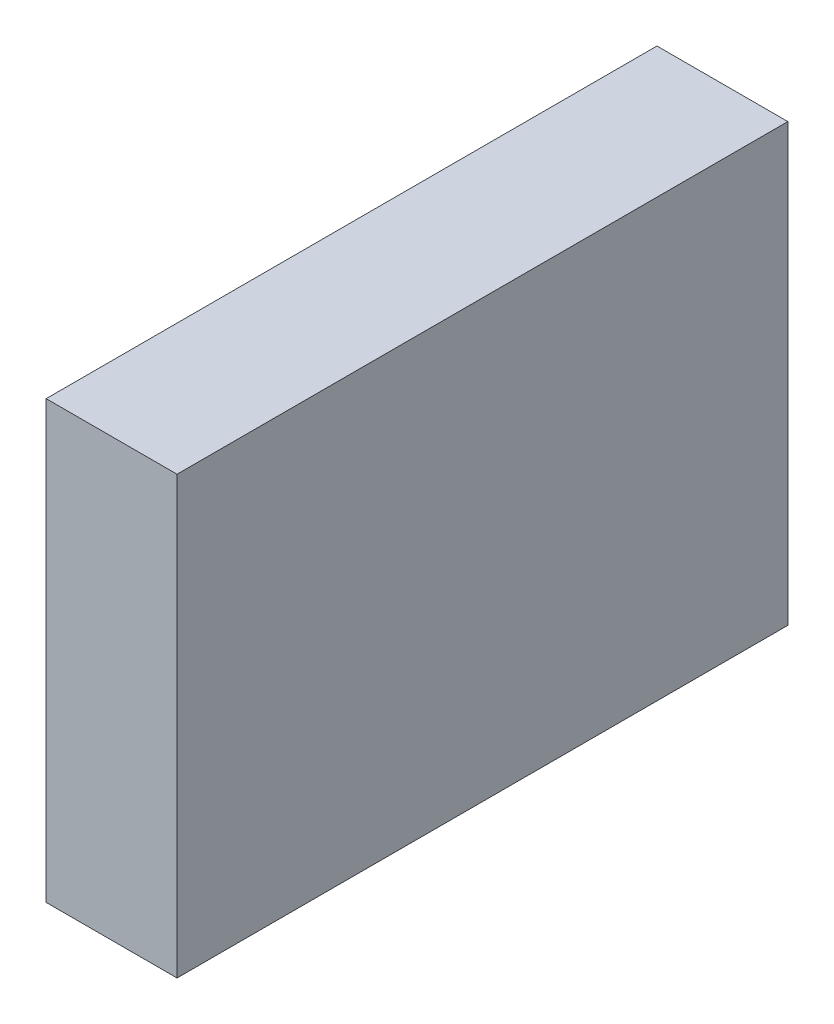
ISO-10303-21;
HEADER;
FILE_DESCRIPTION(('STEP AP214'),'2;1');
FILE_NAME('part.step','',(''),(''),'','','');
FILE_SCHEMA(('AUTOMOTIVE_DESIGN { 1 0 10303 214 1 1 1 1 }'));
ENDSEC;
DATA;
#1=APPLICATION_CONTEXT('core data for automotive mechanical design processes');
#2=APPLICATION_PROTOCOL_DEFINITION('international standard','automotive_design',2000,#1);
#3=PRODUCT_CONTEXT('',#1,'mechanical');
#4=PRODUCT('Part','Part','',(#3));
#5=PRODUCT_RELATED_PRODUCT_CATEGORY('part','',(#4));
#6=PRODUCT_DEFINITION_FORMATION('','',#4);
#7=PRODUCT_DEFINITION_CONTEXT('part definition',#1,'design');
#8=PRODUCT_DEFINITION('design','',#6,#7);
#9=PRODUCT_DEFINITION_SHAPE('','',#8);
#10=(LENGTH_UNIT() NAMED_UNIT(*) SI_UNIT(.MILLI.,.METRE.));
#11=(NAMED_UNIT(*) PLANE_ANGLE_UNIT() SI_UNIT($,.RADIAN.));
#12=(NAMED_UNIT(*) SI_UNIT($,.STERADIAN.) SOLID_ANGLE_UNIT());
#13=UNCERTAINTY_MEASURE_WITH_UNIT(LENGTH_MEASURE(1.E-05),#10,'distance_accuracy_value','');
#14=(GEOMETRIC_REPRESENTATION_CONTEXT(3) GLOBAL_UNCERTAINTY_ASSIGNED_CONTEXT((#13)) GLOBAL_UNIT_ASSIGNED_CONTEXT((#10,
#11,#12)) REPRESENTATION_CONTEXT('',''));
#15=CARTESIAN_POINT('',(0.,0.,0.));
#16=DIRECTION('',(0.,0.,1.));
#17=DIRECTION('',(1.,0.,0.));
#18=AXIS2_PLACEMENT_3D('',#15,#16,#17);
#19=CARTESIAN_POINT('',(-2.99999988110501,0.680000702003896,-3.72112158044361));
#20=DIRECTION('',(1.,-1.74845553146952E-07,0.));
#21=DIRECTION('',(1.74845553146952E-07,1.,-8.74227765734759E-08));
#22=AXIS2_PLACEMENT_3D('',#19,#20,#21);
#23=PLANE('',#22);
#24=DIRECTION('',(1.74845553146599E-07,0.999999999999981,-8.74227765732994E-08));
#25=VECTOR('',#24,1.);
#26=CARTESIAN_POINT('',(-2.99999986886582,0.75000070812249,-3.6511215865632));
#27=LINE('',#26,#25);
#28=CARTESIAN_POINT('',(-2.99999986886582,0.75000070812349,-3.6511215865632));
#29=VERTEX_POINT('',#28);
#30=CARTESIAN_POINT('',(-2.99999969402027,1.75000070812449,-3.65112167398498));
#31=VERTEX_POINT('',#30);
#32=EDGE_CURVE('E11',#29,#31,#27,.T.);
#33=ORIENTED_EDGE('',*,*,#32,.T.);
#34=DIRECTION('',(0.,8.74227764783136E-08,0.999999999999996));
#35=VECTOR('',#34,1.);
#36=CARTESIAN_POINT('',(-2.99999969402027,1.75000070812449,-3.65112167398598));
#37=LINE('',#36,#35);
#38=CARTESIAN_POINT('',(-2.99999969402026,1.75000083051538,-2.25112167398598));
#39=VERTEX_POINT('',#38);
#40=EDGE_CURVE('E69',#31,#39,#37,.T.);
#41=ORIENTED_EDGE('',*,*,#40,.T.);
#42=DIRECTION('',(-1.74845553146599E-07,-0.999999999999981,8.74227761292101E-08));
#43=VECTOR('',#42,1.);
#44=CARTESIAN_POINT('',(-2.99999969402026,1.75000083051638,-2.25112167398598));
#45=LINE('',#44,#43);
#46=CARTESIAN_POINT('',(-2.99999986886581,0.750000830514378,-2.2511215865642));
#47=VERTEX_POINT('',#46);
#48=EDGE_CURVE('E55',#39,#47,#45,.T.);
#49=ORIENTED_EDGE('',*,*,#48,.T.);
#50=DIRECTION('',(0.,-8.74227765576152E-08,-0.999999999999996));
#51=VECTOR('',#50,1.);
#52=CARTESIAN_POINT('',(-2.99999986886581,0.750000830514378,-2.2511215865632));
#53=LINE('',#52,#51);
#54=EDGE_CURVE('E53',#47,#29,#53,.T.);
#55=ORIENTED_EDGE('',*,*,#54,.T.);
#56=EDGE_LOOP('',(#33,#41,#49,#55));
#57=FACE_BOUND('',#56,.T.);
#58=ADVANCED_FACE('F17',(#57),#23,.T.);
#59=CARTESIAN_POINT('',(-3.29999988110501,0.680000754457562,-3.72112158044361));
#60=DIRECTION('',(1.,-1.74845553146952E-07,0.));
#61=DIRECTION('',(1.74845553146952E-07,1.,-8.74227765734759E-08));
#62=AXIS2_PLACEMENT_3D('',#59,#60,#61);
#63=PLANE('',#62);
#64=DIRECTION('',(0.,-8.74227765576152E-08,-0.999999999999996));
#65=VECTOR('',#64,1.);
#66=CARTESIAN_POINT('',(-3.29999986886581,0.750000882968043,-2.2511215865632));
#67=LINE('',#66,#65);
#68=CARTESIAN_POINT('',(-3.29999986886581,0.750000882968043,-2.2511215865642));
#69=VERTEX_POINT('',#68);
#70=CARTESIAN_POINT('',(-3.29999986886582,0.750000760577156,-3.6511215865632));
#71=VERTEX_POINT('',#70);
#72=EDGE_CURVE('E24',#69,#71,#67,.T.);
#73=ORIENTED_EDGE('',*,*,#72,.F.);
#74=DIRECTION('',(-1.74845553146599E-07,-0.999999999999981,8.74227765732993E-08));
#75=VECTOR('',#74,1.);
#76=CARTESIAN_POINT('',(-3.29999969402026,1.75000088297004,-2.25112167398598));
#77=LINE('',#76,#75);
#78=CARTESIAN_POINT('',(-3.29999969402026,1.75000088296904,-2.25112167398598));
#79=VERTEX_POINT('',#78);
#80=EDGE_CURVE('E70',#79,#69,#77,.T.);
#81=ORIENTED_EDGE('',*,*,#80,.F.);
#82=DIRECTION('',(0.,8.74227766369168E-08,0.999999999999996));
#83=VECTOR('',#82,1.);
#84=CARTESIAN_POINT('',(-3.29999969402027,1.75000076057816,-3.65112167398598));
#85=LINE('',#84,#83);
#86=CARTESIAN_POINT('',(-3.29999969402027,1.75000076057816,-3.65112167398498));
#87=VERTEX_POINT('',#86);
#88=EDGE_CURVE('E59',#87,#79,#85,.T.);
#89=ORIENTED_EDGE('',*,*,#88,.F.);
#90=DIRECTION('',(1.74845553146599E-07,0.999999999999981,-8.74227765732994E-08));
#91=VECTOR('',#90,1.);
#92=CARTESIAN_POINT('',(-3.29999986886582,0.750000760576156,-3.6511215865632));
#93=LINE('',#92,#91);
#94=EDGE_CURVE('E78',#71,#87,#93,.T.);
#95=ORIENTED_EDGE('',*,*,#94,.F.);
#96=EDGE_LOOP('',(#73,#81,#89,#95));
#97=FACE_BOUND('',#96,.T.);
#98=ADVANCED_FACE('F89',(#97),#63,.F.);
#99=CARTESIAN_POINT('',(-2.99999986886582,0.75000070812249,-3.6511215865632));
#100=DIRECTION('',(0.,8.74227765734759E-08,1.));
#101=DIRECTION('',(1.74845553146952E-07,1.,-8.74227765734759E-08));
#102=AXIS2_PLACEMENT_3D('',#99,#100,#101);
#103=PLANE('',#102);
#104=DIRECTION('',(-0.999999999999985,1.74845553220964E-07,0.));
#105=VECTOR('',#104,1.);
#106=CARTESIAN_POINT('',(-2.99999986886582,0.75000070812249,-3.6511215865632));
#107=LINE('',#106,#105);
#108=EDGE_CURVE('E65',#29,#71,#107,.T.);
#109=ORIENTED_EDGE('',*,*,#108,.T.);
#110=ORIENTED_EDGE('',*,*,#94,.T.);
#111=DIRECTION('',(-0.999999999999985,1.7484555285089E-07,0.));
#112=VECTOR('',#111,1.);
#113=CARTESIAN_POINT('',(-2.99999969402027,1.75000070812449,-3.65112167398598));
#114=LINE('',#113,#112);
#115=EDGE_CURVE('E66',#31,#87,#114,.T.);
#116=ORIENTED_EDGE('',*,*,#115,.F.);
#117=ORIENTED_EDGE('',*,*,#32,.F.);
#118=EDGE_LOOP('',(#109,#110,#116,#117));
#119=FACE_BOUND('',#118,.T.);
#120=ADVANCED_FACE('F63',(#119),#103,.F.);
#121=CARTESIAN_POINT('',(-2.99999969402027,1.75000070812449,-3.65112167398598));
#122=DIRECTION('',(-1.74845553146952E-07,-1.,8.74227765734759E-08));
#123=DIRECTION('',(0.,8.74227765734759E-08,1.));
#124=AXIS2_PLACEMENT_3D('',#121,#122,#123);
#125=PLANE('',#124);
#126=ORIENTED_EDGE('',*,*,#115,.T.);
#127=ORIENTED_EDGE('',*,*,#88,.T.);
#128=DIRECTION('',(-0.999999999999985,1.7484555285089E-07,0.));
#129=VECTOR('',#128,1.);
#130=CARTESIAN_POINT('',(-2.99999969402026,1.75000083051638,-2.25112167398598));
#131=LINE('',#130,#129);
#132=EDGE_CURVE('E60',#39,#79,#131,.T.);
#133=ORIENTED_EDGE('',*,*,#132,.F.);
#134=ORIENTED_EDGE('',*,*,#40,.F.);
#135=EDGE_LOOP('',(#126,#127,#133,#134));
#136=FACE_BOUND('',#135,.T.);
#137=ADVANCED_FACE('F91',(#136),#125,.F.);
#138=CARTESIAN_POINT('',(-2.99999969402026,1.75000083051638,-2.25112167398598));
#139=DIRECTION('',(0.,-8.74227765734759E-08,-1.));
#140=DIRECTION('',(-1.74845553146952E-07,-1.,8.74227765734759E-08));
#141=AXIS2_PLACEMENT_3D('',#138,#139,#140);
#142=PLANE('',#141);
#143=ORIENTED_EDGE('',*,*,#132,.T.);
#144=ORIENTED_EDGE('',*,*,#80,.T.);
#145=DIRECTION('',(-0.999999999999985,1.74845553220964E-07,0.));
#146=VECTOR('',#145,1.);
#147=CARTESIAN_POINT('',(-2.99999986886581,0.750000830514378,-2.2511215865632));
#148=LINE('',#147,#146);
#149=EDGE_CURVE('E84',#47,#69,#148,.T.);
#150=ORIENTED_EDGE('',*,*,#149,.F.);
#151=ORIENTED_EDGE('',*,*,#48,.F.);
#152=EDGE_LOOP('',(#143,#144,#150,#151));
#153=FACE_BOUND('',#152,.T.);
#154=ADVANCED_FACE('F86',(#153),#142,.F.);
#155=CARTESIAN_POINT('',(-2.99999986886581,0.750000830514378,-2.2511215865632));
#156=DIRECTION('',(1.74845553146952E-07,1.,-8.74227765734759E-08));
#157=DIRECTION('',(0.,-8.74227765734759E-08,-1.));
#158=AXIS2_PLACEMENT_3D('',#155,#156,#157);
#159=PLANE('',#158);
#160=ORIENTED_EDGE('',*,*,#149,.T.);
#161=ORIENTED_EDGE('',*,*,#72,.T.);
#162=ORIENTED_EDGE('',*,*,#108,.F.);
#163=ORIENTED_EDGE('',*,*,#54,.F.);
#164=EDGE_LOOP('',(#160,#161,#162,#163));
#165=FACE_BOUND('',#164,.T.);
#166=ADVANCED_FACE('F68',(#165),#159,.F.);
#167=CLOSED_SHELL('',(#58,#98,#120,#137,#154,#166));
#168=MANIFOLD_SOLID_BREP('B1',#167);
#169=ADVANCED_BREP_SHAPE_REPRESENTATION('',(#18,#168),#14);
#170=SHAPE_DEFINITION_REPRESENTATION(#9,#169);
ENDSEC;
END-ISO-10303-21;
